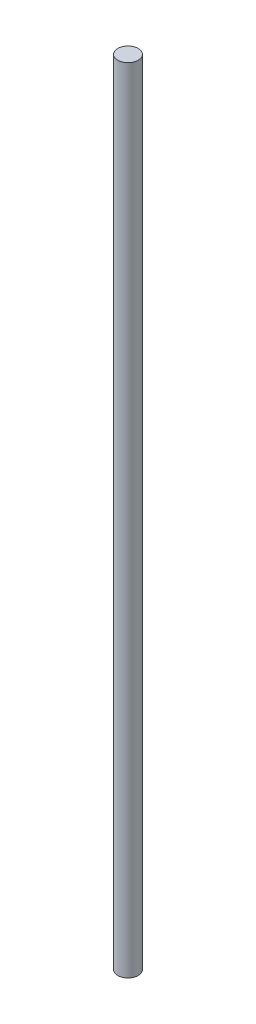
ISO-10303-21;
HEADER;
FILE_DESCRIPTION(('STEP AP214'),'2;1');
FILE_NAME('part.step','',(''),(''),'','','');
FILE_SCHEMA(('AUTOMOTIVE_DESIGN { 1 0 10303 214 1 1 1 1 }'));
ENDSEC;
DATA;
#1=APPLICATION_CONTEXT('core data for automotive mechanical design processes');
#2=APPLICATION_PROTOCOL_DEFINITION('international standard','automotive_design',2000,#1);
#3=PRODUCT_CONTEXT('',#1,'mechanical');
#4=PRODUCT('Part','Part','',(#3));
#5=PRODUCT_RELATED_PRODUCT_CATEGORY('part','',(#4));
#6=PRODUCT_DEFINITION_FORMATION('','',#4);
#7=PRODUCT_DEFINITION_CONTEXT('part definition',#1,'design');
#8=PRODUCT_DEFINITION('design','',#6,#7);
#9=PRODUCT_DEFINITION_SHAPE('','',#8);
#10=(LENGTH_UNIT() NAMED_UNIT(*) SI_UNIT(.MILLI.,.METRE.));
#11=(NAMED_UNIT(*) PLANE_ANGLE_UNIT() SI_UNIT($,.RADIAN.));
#12=(NAMED_UNIT(*) SI_UNIT($,.STERADIAN.) SOLID_ANGLE_UNIT());
#13=UNCERTAINTY_MEASURE_WITH_UNIT(LENGTH_MEASURE(1.E-05),#10,'distance_accuracy_value','');
#14=(GEOMETRIC_REPRESENTATION_CONTEXT(3) GLOBAL_UNCERTAINTY_ASSIGNED_CONTEXT((#13)) GLOBAL_UNIT_ASSIGNED_CONTEXT((#10,
#11,#12)) REPRESENTATION_CONTEXT('',''));
#15=CARTESIAN_POINT('',(0.,0.,0.));
#16=DIRECTION('',(0.,0.,1.));
#17=DIRECTION('',(1.,0.,0.));
#18=AXIS2_PLACEMENT_3D('',#15,#16,#17);
#19=CARTESIAN_POINT('',(0.,310.,0.));
#20=DIRECTION('',(0.,-1.,0.));
#21=DIRECTION('',(0.,0.,-1.));
#22=AXIS2_PLACEMENT_3D('',#19,#20,#21);
#23=CYLINDRICAL_SURFACE('',#22,4.);
#24=CARTESIAN_POINT('',(0.,310.,0.));
#25=DIRECTION('',(0.,1.,0.));
#26=DIRECTION('',(0.,0.,1.));
#27=AXIS2_PLACEMENT_3D('',#24,#25,#26);
#28=CIRCLE('',#27,4.);
#29=CARTESIAN_POINT('',(0.,310.,4.));
#30=VERTEX_POINT('',#29);
#31=EDGE_CURVE('E10',#30,#30,#28,.T.);
#32=ORIENTED_EDGE('',*,*,#31,.F.);
#33=EDGE_LOOP('',(#32));
#34=FACE_BOUND('',#33,.T.);
#35=CARTESIAN_POINT('',(0.,0.,0.));
#36=DIRECTION('',(0.,1.,0.));
#37=DIRECTION('',(0.,0.,1.));
#38=AXIS2_PLACEMENT_3D('',#35,#36,#37);
#39=CIRCLE('',#38,4.);
#40=CARTESIAN_POINT('',(0.,0.,4.));
#41=VERTEX_POINT('',#40);
#42=EDGE_CURVE('E33',#41,#41,#39,.T.);
#43=ORIENTED_EDGE('',*,*,#42,.T.);
#44=EDGE_LOOP('',(#43));
#45=FACE_BOUND('',#44,.T.);
#46=ADVANCED_FACE('F30',(#34,#45),#23,.T.);
#47=CARTESIAN_POINT('',(0.,310.,0.));
#48=DIRECTION('',(0.,1.,0.));
#49=DIRECTION('',(0.,0.,1.));
#50=AXIS2_PLACEMENT_3D('',#47,#48,#49);
#51=PLANE('',#50);
#52=ORIENTED_EDGE('',*,*,#31,.T.);
#53=EDGE_LOOP('',(#52));
#54=FACE_BOUND('',#53,.T.);
#55=ADVANCED_FACE('F45',(#54),#51,.T.);
#56=CARTESIAN_POINT('',(0.,0.,0.));
#57=DIRECTION('',(0.,1.,0.));
#58=DIRECTION('',(0.,0.,1.));
#59=AXIS2_PLACEMENT_3D('',#56,#57,#58);
#60=PLANE('',#59);
#61=ORIENTED_EDGE('',*,*,#42,.F.);
#62=EDGE_LOOP('',(#61));
#63=FACE_BOUND('',#62,.T.);
#64=ADVANCED_FACE('F43',(#63),#60,.F.);
#65=CLOSED_SHELL('',(#46,#55,#64));
#66=MANIFOLD_SOLID_BREP('B2',#65);
#67=ADVANCED_BREP_SHAPE_REPRESENTATION('',(#18,#66),#14);
#68=SHAPE_DEFINITION_REPRESENTATION(#9,#67);
ENDSEC;
END-ISO-10303-21;
